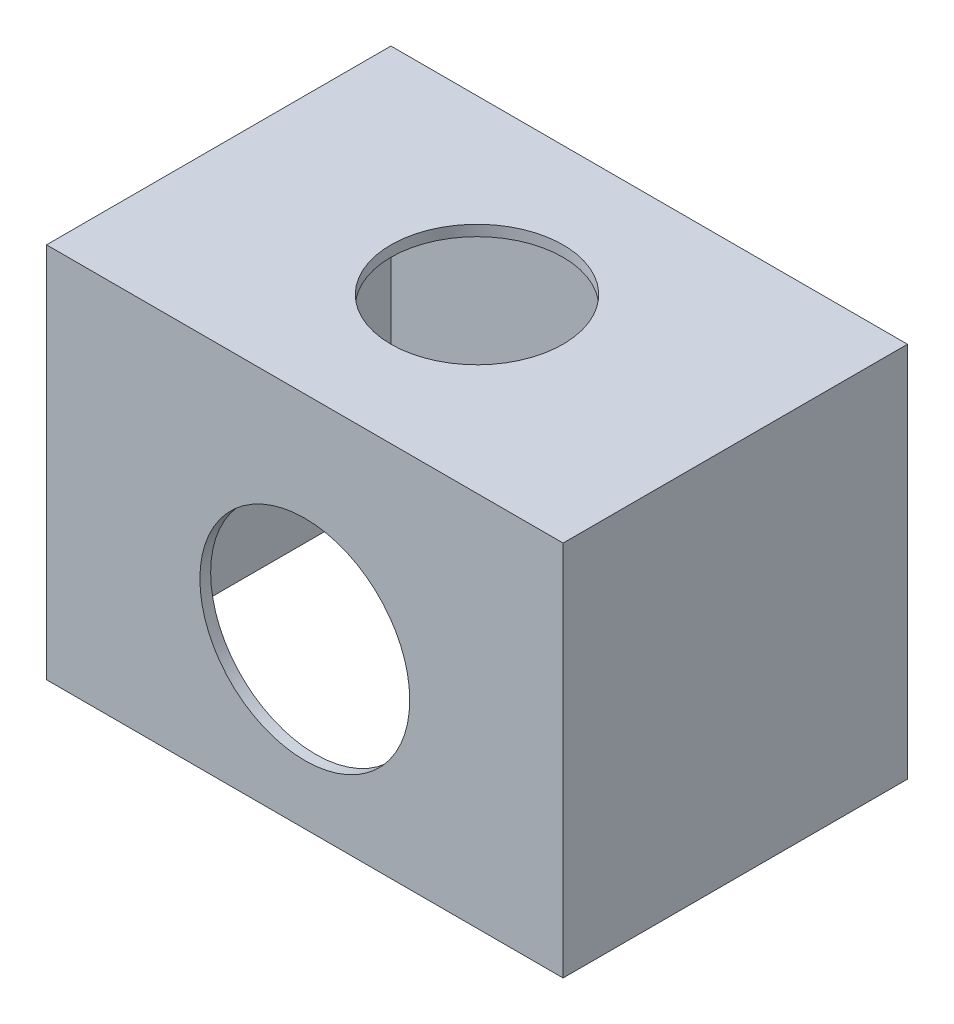
ISO-10303-21;
HEADER;
FILE_DESCRIPTION(('STEP AP214'),'2;1');
FILE_NAME('part.step','',(''),(''),'','','');
FILE_SCHEMA(('AUTOMOTIVE_DESIGN { 1 0 10303 214 1 1 1 1 }'));
ENDSEC;
DATA;
#1=APPLICATION_CONTEXT('core data for automotive mechanical design processes');
#2=APPLICATION_PROTOCOL_DEFINITION('international standard','automotive_design',2000,#1);
#3=PRODUCT_CONTEXT('',#1,'mechanical');
#4=PRODUCT('Part','Part','',(#3));
#5=PRODUCT_RELATED_PRODUCT_CATEGORY('part','',(#4));
#6=PRODUCT_DEFINITION_FORMATION('','',#4);
#7=PRODUCT_DEFINITION_CONTEXT('part definition',#1,'design');
#8=PRODUCT_DEFINITION('design','',#6,#7);
#9=PRODUCT_DEFINITION_SHAPE('','',#8);
#10=(LENGTH_UNIT() NAMED_UNIT(*) SI_UNIT(.MILLI.,.METRE.));
#11=(NAMED_UNIT(*) PLANE_ANGLE_UNIT() SI_UNIT($,.RADIAN.));
#12=(NAMED_UNIT(*) SI_UNIT($,.STERADIAN.) SOLID_ANGLE_UNIT());
#13=UNCERTAINTY_MEASURE_WITH_UNIT(LENGTH_MEASURE(1.E-05),#10,'distance_accuracy_value','');
#14=(GEOMETRIC_REPRESENTATION_CONTEXT(3) GLOBAL_UNCERTAINTY_ASSIGNED_CONTEXT((#13)) GLOBAL_UNIT_ASSIGNED_CONTEXT((#10,
#11,#12)) REPRESENTATION_CONTEXT('',''));
#15=CARTESIAN_POINT('',(0.,0.,0.));
#16=DIRECTION('',(0.,0.,1.));
#17=DIRECTION('',(1.,0.,0.));
#18=AXIS2_PLACEMENT_3D('',#15,#16,#17);
#19=CARTESIAN_POINT('',(0.,0.,0.));
#20=DIRECTION('',(0.,-1.,0.));
#21=DIRECTION('',(0.,0.,-1.));
#22=AXIS2_PLACEMENT_3D('',#19,#20,#21);
#23=PLANE('',#22);
#24=DIRECTION('',(0.,0.,-1.));
#25=VECTOR('',#24,1.);
#26=CARTESIAN_POINT('',(48.,0.,32.));
#27=LINE('',#26,#25);
#28=CARTESIAN_POINT('',(48.,0.,32.));
#29=VERTEX_POINT('',#28);
#30=CARTESIAN_POINT('',(48.,0.,-32.));
#31=VERTEX_POINT('',#30);
#32=EDGE_CURVE('E132',#29,#31,#27,.T.);
#33=ORIENTED_EDGE('',*,*,#32,.F.);
#34=DIRECTION('',(1.,0.,0.));
#35=VECTOR('',#34,1.);
#36=CARTESIAN_POINT('',(-48.,0.,32.));
#37=LINE('',#36,#35);
#38=CARTESIAN_POINT('',(-48.,0.,32.));
#39=VERTEX_POINT('',#38);
#40=EDGE_CURVE('E80',#39,#29,#37,.T.);
#41=ORIENTED_EDGE('',*,*,#40,.F.);
#42=DIRECTION('',(0.,0.,1.));
#43=VECTOR('',#42,1.);
#44=CARTESIAN_POINT('',(-48.,0.,32.));
#45=LINE('',#44,#43);
#46=CARTESIAN_POINT('',(-48.,0.,-32.));
#47=VERTEX_POINT('',#46);
#48=EDGE_CURVE('E164',#47,#39,#45,.T.);
#49=ORIENTED_EDGE('',*,*,#48,.F.);
#50=DIRECTION('',(-1.,0.,0.));
#51=VECTOR('',#50,1.);
#52=CARTESIAN_POINT('',(-48.,0.,-32.));
#53=LINE('',#52,#51);
#54=EDGE_CURVE('E136',#31,#47,#53,.T.);
#55=ORIENTED_EDGE('',*,*,#54,.F.);
#56=EDGE_LOOP('',(#33,#41,#49,#55));
#57=FACE_BOUND('',#56,.T.);
#58=DIRECTION('',(1.,0.,0.));
#59=VECTOR('',#58,1.);
#60=CARTESIAN_POINT('',(0.,0.,30.));
#61=LINE('',#60,#59);
#62=CARTESIAN_POINT('',(-46.,0.,30.));
#63=VERTEX_POINT('',#62);
#64=CARTESIAN_POINT('',(46.,0.,30.));
#65=VERTEX_POINT('',#64);
#66=EDGE_CURVE('E127',#63,#65,#61,.T.);
#67=ORIENTED_EDGE('',*,*,#66,.T.);
#68=DIRECTION('',(0.,0.,-1.));
#69=VECTOR('',#68,1.);
#70=CARTESIAN_POINT('',(46.,0.,0.));
#71=LINE('',#70,#69);
#72=CARTESIAN_POINT('',(46.,0.,-30.));
#73=VERTEX_POINT('',#72);
#74=EDGE_CURVE('E149',#65,#73,#71,.T.);
#75=ORIENTED_EDGE('',*,*,#74,.T.);
#76=DIRECTION('',(-1.,0.,0.));
#77=VECTOR('',#76,1.);
#78=CARTESIAN_POINT('',(0.,0.,-30.));
#79=LINE('',#78,#77);
#80=CARTESIAN_POINT('',(-46.,0.,-30.));
#81=VERTEX_POINT('',#80);
#82=EDGE_CURVE('E131',#73,#81,#79,.T.);
#83=ORIENTED_EDGE('',*,*,#82,.T.);
#84=DIRECTION('',(0.,0.,1.));
#85=VECTOR('',#84,1.);
#86=CARTESIAN_POINT('',(-46.,0.,0.));
#87=LINE('',#86,#85);
#88=EDGE_CURVE('E50',#81,#63,#87,.T.);
#89=ORIENTED_EDGE('',*,*,#88,.T.);
#90=EDGE_LOOP('',(#67,#75,#83,#89));
#91=FACE_BOUND('',#90,.T.);
#92=ADVANCED_FACE('F33',(#57,#91),#23,.T.);
#93=CARTESIAN_POINT('',(48.,70.,32.));
#94=DIRECTION('',(-1.,0.,0.));
#95=DIRECTION('',(0.,0.,1.));
#96=AXIS2_PLACEMENT_3D('',#93,#94,#95);
#97=PLANE('',#96);
#98=ORIENTED_EDGE('',*,*,#32,.T.);
#99=DIRECTION('',(0.,-1.,0.));
#100=VECTOR('',#99,1.);
#101=CARTESIAN_POINT('',(48.,70.,-32.));
#102=LINE('',#101,#100);
#103=CARTESIAN_POINT('',(48.,70.,-32.));
#104=VERTEX_POINT('',#103);
#105=EDGE_CURVE('E11',#104,#31,#102,.T.);
#106=ORIENTED_EDGE('',*,*,#105,.F.);
#107=DIRECTION('',(0.,0.,-1.));
#108=VECTOR('',#107,1.);
#109=CARTESIAN_POINT('',(48.,70.,32.));
#110=LINE('',#109,#108);
#111=CARTESIAN_POINT('',(48.,70.,32.));
#112=VERTEX_POINT('',#111);
#113=EDGE_CURVE('E156',#112,#104,#110,.T.);
#114=ORIENTED_EDGE('',*,*,#113,.F.);
#115=DIRECTION('',(0.,-1.,0.));
#116=VECTOR('',#115,1.);
#117=CARTESIAN_POINT('',(48.,70.,32.));
#118=LINE('',#117,#116);
#119=EDGE_CURVE('E161',#112,#29,#118,.T.);
#120=ORIENTED_EDGE('',*,*,#119,.T.);
#121=EDGE_LOOP('',(#98,#106,#114,#120));
#122=FACE_BOUND('',#121,.T.);
#123=ADVANCED_FACE('F35',(#122),#97,.F.);
#124=CARTESIAN_POINT('',(-48.,70.,-32.));
#125=DIRECTION('',(0.,0.,1.));
#126=DIRECTION('',(1.,0.,0.));
#127=AXIS2_PLACEMENT_3D('',#124,#125,#126);
#128=PLANE('',#127);
#129=ORIENTED_EDGE('',*,*,#54,.T.);
#130=DIRECTION('',(0.,-1.,0.));
#131=VECTOR('',#130,1.);
#132=CARTESIAN_POINT('',(-48.,70.,-32.));
#133=LINE('',#132,#131);
#134=CARTESIAN_POINT('',(-48.,70.,-32.));
#135=VERTEX_POINT('',#134);
#136=EDGE_CURVE('E42',#135,#47,#133,.T.);
#137=ORIENTED_EDGE('',*,*,#136,.F.);
#138=DIRECTION('',(-1.,0.,0.));
#139=VECTOR('',#138,1.);
#140=CARTESIAN_POINT('',(-48.,70.,-32.));
#141=LINE('',#140,#139);
#142=EDGE_CURVE('E87',#104,#135,#141,.T.);
#143=ORIENTED_EDGE('',*,*,#142,.F.);
#144=ORIENTED_EDGE('',*,*,#105,.T.);
#145=EDGE_LOOP('',(#129,#137,#143,#144));
#146=FACE_BOUND('',#145,.T.);
#147=ADVANCED_FACE('F197',(#146),#128,.F.);
#148=CARTESIAN_POINT('',(-48.,70.,32.));
#149=DIRECTION('',(1.,0.,0.));
#150=DIRECTION('',(0.,0.,-1.));
#151=AXIS2_PLACEMENT_3D('',#148,#149,#150);
#152=PLANE('',#151);
#153=ORIENTED_EDGE('',*,*,#48,.T.);
#154=DIRECTION('',(0.,-1.,0.));
#155=VECTOR('',#154,1.);
#156=CARTESIAN_POINT('',(-48.,70.,32.));
#157=LINE('',#156,#155);
#158=CARTESIAN_POINT('',(-48.,70.,32.));
#159=VERTEX_POINT('',#158);
#160=EDGE_CURVE('E168',#159,#39,#157,.T.);
#161=ORIENTED_EDGE('',*,*,#160,.F.);
#162=DIRECTION('',(0.,0.,1.));
#163=VECTOR('',#162,1.);
#164=CARTESIAN_POINT('',(-48.,70.,32.));
#165=LINE('',#164,#163);
#166=EDGE_CURVE('E159',#135,#159,#165,.T.);
#167=ORIENTED_EDGE('',*,*,#166,.F.);
#168=ORIENTED_EDGE('',*,*,#136,.T.);
#169=EDGE_LOOP('',(#153,#161,#167,#168));
#170=FACE_BOUND('',#169,.T.);
#171=ADVANCED_FACE('F189',(#170),#152,.F.);
#172=CARTESIAN_POINT('',(-48.,70.,32.));
#173=DIRECTION('',(0.,0.,-1.));
#174=DIRECTION('',(-1.,0.,0.));
#175=AXIS2_PLACEMENT_3D('',#172,#173,#174);
#176=PLANE('',#175);
#177=CARTESIAN_POINT('',(0.,30.5,32.));
#178=DIRECTION('',(0.,0.,1.));
#179=DIRECTION('',(1.,0.,0.));
#180=AXIS2_PLACEMENT_3D('',#177,#178,#179);
#181=CIRCLE('',#180,19.5);
#182=CARTESIAN_POINT('',(19.5,30.5,32.));
#183=VERTEX_POINT('',#182);
#184=EDGE_CURVE('E178',#183,#183,#181,.T.);
#185=ORIENTED_EDGE('',*,*,#184,.F.);
#186=EDGE_LOOP('',(#185));
#187=FACE_BOUND('',#186,.T.);
#188=ORIENTED_EDGE('',*,*,#40,.T.);
#189=ORIENTED_EDGE('',*,*,#119,.F.);
#190=DIRECTION('',(1.,0.,0.));
#191=VECTOR('',#190,1.);
#192=CARTESIAN_POINT('',(-48.,70.,32.));
#193=LINE('',#192,#191);
#194=EDGE_CURVE('E59',#159,#112,#193,.T.);
#195=ORIENTED_EDGE('',*,*,#194,.F.);
#196=ORIENTED_EDGE('',*,*,#160,.T.);
#197=EDGE_LOOP('',(#188,#189,#195,#196));
#198=FACE_BOUND('',#197,.T.);
#199=ADVANCED_FACE('F186',(#187,#198),#176,.F.);
#200=CARTESIAN_POINT('',(0.,70.,0.));
#201=DIRECTION('',(0.,-1.,0.));
#202=DIRECTION('',(0.,0.,-1.));
#203=AXIS2_PLACEMENT_3D('',#200,#201,#202);
#204=PLANE('',#203);
#205=CARTESIAN_POINT('',(0.,70.,0.));
#206=DIRECTION('',(0.,1.,0.));
#207=DIRECTION('',(0.,0.,1.));
#208=AXIS2_PLACEMENT_3D('',#205,#206,#207);
#209=CIRCLE('',#208,16.);
#210=CARTESIAN_POINT('',(0.,70.,16.));
#211=VERTEX_POINT('',#210);
#212=EDGE_CURVE('E141',#211,#211,#209,.T.);
#213=ORIENTED_EDGE('',*,*,#212,.F.);
#214=EDGE_LOOP('',(#213));
#215=FACE_BOUND('',#214,.T.);
#216=ORIENTED_EDGE('',*,*,#113,.T.);
#217=ORIENTED_EDGE('',*,*,#142,.T.);
#218=ORIENTED_EDGE('',*,*,#166,.T.);
#219=ORIENTED_EDGE('',*,*,#194,.T.);
#220=EDGE_LOOP('',(#216,#217,#218,#219));
#221=FACE_BOUND('',#220,.T.);
#222=ADVANCED_FACE('F188',(#215,#221),#204,.F.);
#223=CARTESIAN_POINT('',(46.,70.,32.));
#224=DIRECTION('',(-1.,0.,0.));
#225=DIRECTION('',(0.,0.,1.));
#226=AXIS2_PLACEMENT_3D('',#223,#224,#225);
#227=PLANE('',#226);
#228=ORIENTED_EDGE('',*,*,#74,.F.);
#229=DIRECTION('',(0.,-1.,0.));
#230=VECTOR('',#229,1.);
#231=CARTESIAN_POINT('',(46.,70.,30.));
#232=LINE('',#231,#230);
#233=CARTESIAN_POINT('',(46.,68.,30.));
#234=VERTEX_POINT('',#233);
#235=EDGE_CURVE('E126',#234,#65,#232,.T.);
#236=ORIENTED_EDGE('',*,*,#235,.F.);
#237=DIRECTION('',(0.,0.,-1.));
#238=VECTOR('',#237,1.);
#239=CARTESIAN_POINT('',(46.,68.,0.));
#240=LINE('',#239,#238);
#241=CARTESIAN_POINT('',(46.,68.,-30.));
#242=VERTEX_POINT('',#241);
#243=EDGE_CURVE('E114',#234,#242,#240,.T.);
#244=ORIENTED_EDGE('',*,*,#243,.T.);
#245=DIRECTION('',(0.,-1.,0.));
#246=VECTOR('',#245,1.);
#247=CARTESIAN_POINT('',(46.,70.,-30.));
#248=LINE('',#247,#246);
#249=EDGE_CURVE('E124',#242,#73,#248,.T.);
#250=ORIENTED_EDGE('',*,*,#249,.T.);
#251=EDGE_LOOP('',(#228,#236,#244,#250));
#252=FACE_BOUND('',#251,.T.);
#253=ADVANCED_FACE('F123',(#252),#227,.T.);
#254=CARTESIAN_POINT('',(-48.,70.,-30.));
#255=DIRECTION('',(0.,0.,1.));
#256=DIRECTION('',(1.,0.,0.));
#257=AXIS2_PLACEMENT_3D('',#254,#255,#256);
#258=PLANE('',#257);
#259=ORIENTED_EDGE('',*,*,#82,.F.);
#260=ORIENTED_EDGE('',*,*,#249,.F.);
#261=DIRECTION('',(-1.,0.,0.));
#262=VECTOR('',#261,1.);
#263=CARTESIAN_POINT('',(0.,68.,-30.));
#264=LINE('',#263,#262);
#265=CARTESIAN_POINT('',(-46.,68.,-30.));
#266=VERTEX_POINT('',#265);
#267=EDGE_CURVE('E110',#242,#266,#264,.T.);
#268=ORIENTED_EDGE('',*,*,#267,.T.);
#269=DIRECTION('',(0.,-1.,0.));
#270=VECTOR('',#269,1.);
#271=CARTESIAN_POINT('',(-46.,70.,-30.));
#272=LINE('',#271,#270);
#273=EDGE_CURVE('E133',#266,#81,#272,.T.);
#274=ORIENTED_EDGE('',*,*,#273,.T.);
#275=EDGE_LOOP('',(#259,#260,#268,#274));
#276=FACE_BOUND('',#275,.T.);
#277=ADVANCED_FACE('F129',(#276),#258,.T.);
#278=CARTESIAN_POINT('',(-46.,70.,32.));
#279=DIRECTION('',(1.,0.,0.));
#280=DIRECTION('',(0.,0.,-1.));
#281=AXIS2_PLACEMENT_3D('',#278,#279,#280);
#282=PLANE('',#281);
#283=ORIENTED_EDGE('',*,*,#88,.F.);
#284=ORIENTED_EDGE('',*,*,#273,.F.);
#285=DIRECTION('',(0.,0.,1.));
#286=VECTOR('',#285,1.);
#287=CARTESIAN_POINT('',(-46.,68.,0.));
#288=LINE('',#287,#286);
#289=CARTESIAN_POINT('',(-46.,68.,30.));
#290=VERTEX_POINT('',#289);
#291=EDGE_CURVE('E115',#266,#290,#288,.T.);
#292=ORIENTED_EDGE('',*,*,#291,.T.);
#293=DIRECTION('',(0.,-1.,0.));
#294=VECTOR('',#293,1.);
#295=CARTESIAN_POINT('',(-46.,70.,30.));
#296=LINE('',#295,#294);
#297=EDGE_CURVE('E138',#290,#63,#296,.T.);
#298=ORIENTED_EDGE('',*,*,#297,.T.);
#299=EDGE_LOOP('',(#283,#284,#292,#298));
#300=FACE_BOUND('',#299,.T.);
#301=ADVANCED_FACE('F217',(#300),#282,.T.);
#302=CARTESIAN_POINT('',(-48.,70.,30.));
#303=DIRECTION('',(0.,0.,-1.));
#304=DIRECTION('',(-1.,0.,0.));
#305=AXIS2_PLACEMENT_3D('',#302,#303,#304);
#306=PLANE('',#305);
#307=CARTESIAN_POINT('',(0.,30.5,30.));
#308=DIRECTION('',(0.,0.,-1.));
#309=DIRECTION('',(-1.,0.,0.));
#310=AXIS2_PLACEMENT_3D('',#307,#308,#309);
#311=CIRCLE('',#310,19.5);
#312=CARTESIAN_POINT('',(-19.5,30.5,30.));
#313=VERTEX_POINT('',#312);
#314=EDGE_CURVE('E37',#313,#313,#311,.T.);
#315=ORIENTED_EDGE('',*,*,#314,.F.);
#316=EDGE_LOOP('',(#315));
#317=FACE_BOUND('',#316,.T.);
#318=ORIENTED_EDGE('',*,*,#66,.F.);
#319=ORIENTED_EDGE('',*,*,#297,.F.);
#320=DIRECTION('',(1.,0.,0.));
#321=VECTOR('',#320,1.);
#322=CARTESIAN_POINT('',(0.,68.,30.));
#323=LINE('',#322,#321);
#324=EDGE_CURVE('E144',#290,#234,#323,.T.);
#325=ORIENTED_EDGE('',*,*,#324,.T.);
#326=ORIENTED_EDGE('',*,*,#235,.T.);
#327=EDGE_LOOP('',(#318,#319,#325,#326));
#328=FACE_BOUND('',#327,.T.);
#329=ADVANCED_FACE('F213',(#317,#328),#306,.T.);
#330=CARTESIAN_POINT('',(0.,68.,0.));
#331=DIRECTION('',(0.,-1.,0.));
#332=DIRECTION('',(0.,0.,-1.));
#333=AXIS2_PLACEMENT_3D('',#330,#331,#332);
#334=PLANE('',#333);
#335=CARTESIAN_POINT('',(0.,68.,0.));
#336=DIRECTION('',(0.,-1.,0.));
#337=DIRECTION('',(0.,0.,-1.));
#338=AXIS2_PLACEMENT_3D('',#335,#336,#337);
#339=CIRCLE('',#338,16.);
#340=CARTESIAN_POINT('',(0.,68.,-16.));
#341=VERTEX_POINT('',#340);
#342=EDGE_CURVE('E151',#341,#341,#339,.T.);
#343=ORIENTED_EDGE('',*,*,#342,.F.);
#344=EDGE_LOOP('',(#343));
#345=FACE_BOUND('',#344,.T.);
#346=ORIENTED_EDGE('',*,*,#243,.F.);
#347=ORIENTED_EDGE('',*,*,#324,.F.);
#348=ORIENTED_EDGE('',*,*,#291,.F.);
#349=ORIENTED_EDGE('',*,*,#267,.F.);
#350=EDGE_LOOP('',(#346,#347,#348,#349));
#351=FACE_BOUND('',#350,.T.);
#352=ADVANCED_FACE('F112',(#345,#351),#334,.T.);
#353=CARTESIAN_POINT('',(0.,65.,0.));
#354=DIRECTION('',(0.,1.,0.));
#355=DIRECTION('',(0.,0.,1.));
#356=AXIS2_PLACEMENT_3D('',#353,#354,#355);
#357=CYLINDRICAL_SURFACE('',#356,16.);
#358=ORIENTED_EDGE('',*,*,#342,.T.);
#359=EDGE_LOOP('',(#358));
#360=FACE_BOUND('',#359,.T.);
#361=ORIENTED_EDGE('',*,*,#212,.T.);
#362=EDGE_LOOP('',(#361));
#363=FACE_BOUND('',#362,.T.);
#364=ADVANCED_FACE('F212',(#360,#363),#357,.F.);
#365=CARTESIAN_POINT('',(0.,30.5,27.));
#366=DIRECTION('',(0.,0.,1.));
#367=DIRECTION('',(1.,0.,0.));
#368=AXIS2_PLACEMENT_3D('',#365,#366,#367);
#369=CYLINDRICAL_SURFACE('',#368,19.5);
#370=ORIENTED_EDGE('',*,*,#314,.T.);
#371=EDGE_LOOP('',(#370));
#372=FACE_BOUND('',#371,.T.);
#373=ORIENTED_EDGE('',*,*,#184,.T.);
#374=EDGE_LOOP('',(#373));
#375=FACE_BOUND('',#374,.T.);
#376=ADVANCED_FACE('F184',(#372,#375),#369,.F.);
#377=CLOSED_SHELL('',(#92,#123,#147,#171,#199,#222,#253,#277,#301,#329,#352,#364,#376));
#378=MANIFOLD_SOLID_BREP('B2',#377);
#379=ADVANCED_BREP_SHAPE_REPRESENTATION('',(#18,#378),#14);
#380=SHAPE_DEFINITION_REPRESENTATION(#9,#379);
ENDSEC;
END-ISO-10303-21;
